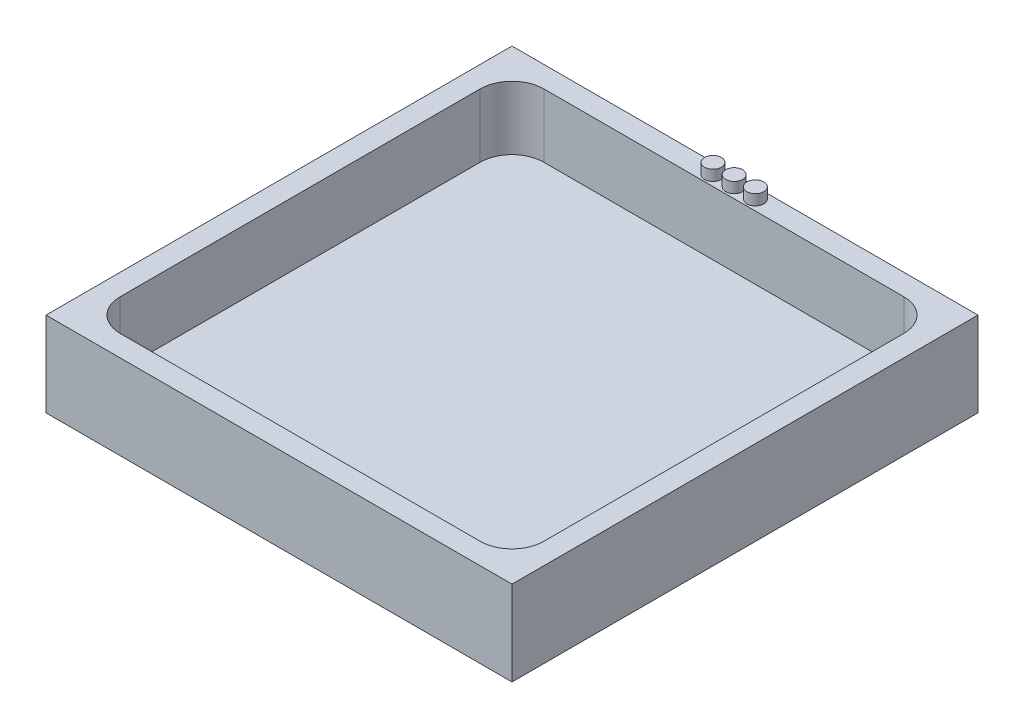
ISO-10303-21;
HEADER;
FILE_DESCRIPTION(('STEP AP214'),'2;1');
FILE_NAME('part.step','',(''),(''),'','','');
FILE_SCHEMA(('AUTOMOTIVE_DESIGN { 1 0 10303 214 1 1 1 1 }'));
ENDSEC;
DATA;
#1=APPLICATION_CONTEXT('core data for automotive mechanical design processes');
#2=APPLICATION_PROTOCOL_DEFINITION('international standard','automotive_design',2000,#1);
#3=PRODUCT_CONTEXT('',#1,'mechanical');
#4=PRODUCT('Part','Part','',(#3));
#5=PRODUCT_RELATED_PRODUCT_CATEGORY('part','',(#4));
#6=PRODUCT_DEFINITION_FORMATION('','',#4);
#7=PRODUCT_DEFINITION_CONTEXT('part definition',#1,'design');
#8=PRODUCT_DEFINITION('design','',#6,#7);
#9=PRODUCT_DEFINITION_SHAPE('','',#8);
#10=(LENGTH_UNIT() NAMED_UNIT(*) SI_UNIT(.MILLI.,.METRE.));
#11=(NAMED_UNIT(*) PLANE_ANGLE_UNIT() SI_UNIT($,.RADIAN.));
#12=(NAMED_UNIT(*) SI_UNIT($,.STERADIAN.) SOLID_ANGLE_UNIT());
#13=UNCERTAINTY_MEASURE_WITH_UNIT(LENGTH_MEASURE(1.E-05),#10,'distance_accuracy_value','');
#14=(GEOMETRIC_REPRESENTATION_CONTEXT(3) GLOBAL_UNCERTAINTY_ASSIGNED_CONTEXT((#13)) GLOBAL_UNIT_ASSIGNED_CONTEXT((#10,
#11,#12)) REPRESENTATION_CONTEXT('',''));
#15=CARTESIAN_POINT('',(0.,0.,0.));
#16=DIRECTION('',(0.,0.,1.));
#17=DIRECTION('',(1.,0.,0.));
#18=AXIS2_PLACEMENT_3D('',#15,#16,#17);
#19=CARTESIAN_POINT('',(0.,1.,0.));
#20=DIRECTION('',(0.,-1.,0.));
#21=DIRECTION('',(0.,0.,-1.));
#22=AXIS2_PLACEMENT_3D('',#19,#20,#21);
#23=PLANE('',#22);
#24=DIRECTION('',(1.,0.,0.));
#25=VECTOR('',#24,1.);
#26=CARTESIAN_POINT('',(-10.,1.,10.));
#27=LINE('',#26,#25);
#28=CARTESIAN_POINT('',(-8.5,1.,10.));
#29=VERTEX_POINT('',#28);
#30=CARTESIAN_POINT('',(8.5,1.,10.));
#31=VERTEX_POINT('',#30);
#32=EDGE_CURVE('E166',#29,#31,#27,.T.);
#33=ORIENTED_EDGE('',*,*,#32,.T.);
#34=CARTESIAN_POINT('',(8.5,1.,8.5));
#35=DIRECTION('',(0.,-1.,0.));
#36=DIRECTION('',(0.,0.,-1.));
#37=AXIS2_PLACEMENT_3D('',#34,#35,#36);
#38=CIRCLE('',#37,1.5);
#39=CARTESIAN_POINT('',(10.,1.,8.5));
#40=VERTEX_POINT('',#39);
#41=EDGE_CURVE('E189',#31,#40,#38,.F.);
#42=ORIENTED_EDGE('',*,*,#41,.T.);
#43=DIRECTION('',(0.,0.,-1.));
#44=VECTOR('',#43,1.);
#45=CARTESIAN_POINT('',(10.,1.,10.));
#46=LINE('',#45,#44);
#47=CARTESIAN_POINT('',(10.,1.,-8.5));
#48=VERTEX_POINT('',#47);
#49=EDGE_CURVE('E163',#40,#48,#46,.T.);
#50=ORIENTED_EDGE('',*,*,#49,.T.);
#51=CARTESIAN_POINT('',(8.5,1.,-8.5));
#52=DIRECTION('',(0.,-1.,0.));
#53=DIRECTION('',(0.,0.,-1.));
#54=AXIS2_PLACEMENT_3D('',#51,#52,#53);
#55=CIRCLE('',#54,1.5);
#56=CARTESIAN_POINT('',(8.5,1.,-10.));
#57=VERTEX_POINT('',#56);
#58=EDGE_CURVE('E183',#48,#57,#55,.F.);
#59=ORIENTED_EDGE('',*,*,#58,.T.);
#60=DIRECTION('',(1.,0.,0.));
#61=VECTOR('',#60,1.);
#62=CARTESIAN_POINT('',(-10.,1.,-10.));
#63=LINE('',#62,#61);
#64=CARTESIAN_POINT('',(-8.5,1.,-10.));
#65=VERTEX_POINT('',#64);
#66=EDGE_CURVE('E155',#65,#57,#63,.T.);
#67=ORIENTED_EDGE('',*,*,#66,.F.);
#68=CARTESIAN_POINT('',(-8.5,1.,-8.5));
#69=DIRECTION('',(0.,-1.,0.));
#70=DIRECTION('',(0.,0.,-1.));
#71=AXIS2_PLACEMENT_3D('',#68,#69,#70);
#72=CIRCLE('',#71,1.5);
#73=CARTESIAN_POINT('',(-10.,1.,-8.5));
#74=VERTEX_POINT('',#73);
#75=EDGE_CURVE('E187',#65,#74,#72,.F.);
#76=ORIENTED_EDGE('',*,*,#75,.T.);
#77=DIRECTION('',(0.,0.,-1.));
#78=VECTOR('',#77,1.);
#79=CARTESIAN_POINT('',(-10.,1.,10.));
#80=LINE('',#79,#78);
#81=CARTESIAN_POINT('',(-10.,1.,8.5));
#82=VERTEX_POINT('',#81);
#83=EDGE_CURVE('E153',#82,#74,#80,.T.);
#84=ORIENTED_EDGE('',*,*,#83,.F.);
#85=CARTESIAN_POINT('',(-8.5,1.,8.5));
#86=DIRECTION('',(0.,-1.,0.));
#87=DIRECTION('',(0.,0.,-1.));
#88=AXIS2_PLACEMENT_3D('',#85,#86,#87);
#89=CIRCLE('',#88,1.5);
#90=EDGE_CURVE('E185',#82,#29,#89,.F.);
#91=ORIENTED_EDGE('',*,*,#90,.T.);
#92=EDGE_LOOP('',(#33,#42,#50,#59,#67,#76,#84,#91));
#93=FACE_BOUND('',#92,.T.);
#94=ADVANCED_FACE('F39',(#93),#23,.F.);
#95=CARTESIAN_POINT('',(10.,4.,10.));
#96=DIRECTION('',(-1.,0.,0.));
#97=DIRECTION('',(0.,0.,1.));
#98=AXIS2_PLACEMENT_3D('',#95,#96,#97);
#99=PLANE('',#98);
#100=ORIENTED_EDGE('',*,*,#49,.F.);
#101=DIRECTION('',(0.,-1.,0.));
#102=VECTOR('',#101,1.);
#103=CARTESIAN_POINT('',(10.,4.,8.5));
#104=LINE('',#103,#102);
#105=CARTESIAN_POINT('',(10.,4.,8.5));
#106=VERTEX_POINT('',#105);
#107=EDGE_CURVE('E194',#40,#106,#104,.F.);
#108=ORIENTED_EDGE('',*,*,#107,.T.);
#109=DIRECTION('',(0.,0.,-1.));
#110=VECTOR('',#109,1.);
#111=CARTESIAN_POINT('',(10.,4.,10.));
#112=LINE('',#111,#110);
#113=CARTESIAN_POINT('',(10.,4.,-8.5));
#114=VERTEX_POINT('',#113);
#115=EDGE_CURVE('E221',#106,#114,#112,.T.);
#116=ORIENTED_EDGE('',*,*,#115,.T.);
#117=DIRECTION('',(0.,-1.,0.));
#118=VECTOR('',#117,1.);
#119=CARTESIAN_POINT('',(10.,1.,-8.5));
#120=LINE('',#119,#118);
#121=EDGE_CURVE('E191',#114,#48,#120,.T.);
#122=ORIENTED_EDGE('',*,*,#121,.T.);
#123=EDGE_LOOP('',(#100,#108,#116,#122));
#124=FACE_BOUND('',#123,.T.);
#125=ADVANCED_FACE('F243',(#124),#99,.T.);
#126=CARTESIAN_POINT('',(-10.,4.,-10.));
#127=DIRECTION('',(0.,0.,1.));
#128=DIRECTION('',(1.,0.,0.));
#129=AXIS2_PLACEMENT_3D('',#126,#127,#128);
#130=PLANE('',#129);
#131=DIRECTION('',(-1.,0.,0.));
#132=VECTOR('',#131,1.);
#133=CARTESIAN_POINT('',(-10.,4.,-10.));
#134=LINE('',#133,#132);
#135=CARTESIAN_POINT('',(8.5,4.,-10.));
#136=VERTEX_POINT('',#135);
#137=CARTESIAN_POINT('',(-8.5,4.,-10.));
#138=VERTEX_POINT('',#137);
#139=EDGE_CURVE('E212',#136,#138,#134,.T.);
#140=ORIENTED_EDGE('',*,*,#139,.T.);
#141=DIRECTION('',(0.,-1.,0.));
#142=VECTOR('',#141,1.);
#143=CARTESIAN_POINT('',(-8.5,1.,-10.));
#144=LINE('',#143,#142);
#145=EDGE_CURVE('E198',#138,#65,#144,.T.);
#146=ORIENTED_EDGE('',*,*,#145,.T.);
#147=ORIENTED_EDGE('',*,*,#66,.T.);
#148=DIRECTION('',(0.,-1.,0.));
#149=VECTOR('',#148,1.);
#150=CARTESIAN_POINT('',(8.5,4.,-10.));
#151=LINE('',#150,#149);
#152=EDGE_CURVE('E196',#57,#136,#151,.F.);
#153=ORIENTED_EDGE('',*,*,#152,.T.);
#154=EDGE_LOOP('',(#140,#146,#147,#153));
#155=FACE_BOUND('',#154,.T.);
#156=ADVANCED_FACE('F218',(#155),#130,.T.);
#157=CARTESIAN_POINT('',(-10.,4.,10.));
#158=DIRECTION('',(1.,0.,0.));
#159=DIRECTION('',(0.,0.,-1.));
#160=AXIS2_PLACEMENT_3D('',#157,#158,#159);
#161=PLANE('',#160);
#162=ORIENTED_EDGE('',*,*,#83,.T.);
#163=DIRECTION('',(0.,-1.,0.));
#164=VECTOR('',#163,1.);
#165=CARTESIAN_POINT('',(-10.,4.,-8.5));
#166=LINE('',#165,#164);
#167=CARTESIAN_POINT('',(-10.,4.,-8.5));
#168=VERTEX_POINT('',#167);
#169=EDGE_CURVE('E60',#74,#168,#166,.F.);
#170=ORIENTED_EDGE('',*,*,#169,.T.);
#171=DIRECTION('',(0.,0.,1.));
#172=VECTOR('',#171,1.);
#173=CARTESIAN_POINT('',(-10.,4.,10.));
#174=LINE('',#173,#172);
#175=CARTESIAN_POINT('',(-10.,4.,8.5));
#176=VERTEX_POINT('',#175);
#177=EDGE_CURVE('E214',#168,#176,#174,.T.);
#178=ORIENTED_EDGE('',*,*,#177,.T.);
#179=DIRECTION('',(0.,-1.,0.));
#180=VECTOR('',#179,1.);
#181=CARTESIAN_POINT('',(-10.,1.,8.5));
#182=LINE('',#181,#180);
#183=EDGE_CURVE('E201',#176,#82,#182,.T.);
#184=ORIENTED_EDGE('',*,*,#183,.T.);
#185=EDGE_LOOP('',(#162,#170,#178,#184));
#186=FACE_BOUND('',#185,.T.);
#187=ADVANCED_FACE('F226',(#186),#161,.T.);
#188=CARTESIAN_POINT('',(-10.,4.,10.));
#189=DIRECTION('',(0.,0.,-1.));
#190=DIRECTION('',(-1.,0.,0.));
#191=AXIS2_PLACEMENT_3D('',#188,#189,#190);
#192=PLANE('',#191);
#193=DIRECTION('',(1.,0.,0.));
#194=VECTOR('',#193,1.);
#195=CARTESIAN_POINT('',(-10.,4.,10.));
#196=LINE('',#195,#194);
#197=CARTESIAN_POINT('',(-8.5,4.,10.));
#198=VERTEX_POINT('',#197);
#199=CARTESIAN_POINT('',(8.5,4.,10.));
#200=VERTEX_POINT('',#199);
#201=EDGE_CURVE('E236',#198,#200,#196,.T.);
#202=ORIENTED_EDGE('',*,*,#201,.T.);
#203=DIRECTION('',(0.,-1.,0.));
#204=VECTOR('',#203,1.);
#205=CARTESIAN_POINT('',(8.5,1.,10.));
#206=LINE('',#205,#204);
#207=EDGE_CURVE('E180',#200,#31,#206,.T.);
#208=ORIENTED_EDGE('',*,*,#207,.T.);
#209=ORIENTED_EDGE('',*,*,#32,.F.);
#210=DIRECTION('',(0.,-1.,0.));
#211=VECTOR('',#210,1.);
#212=CARTESIAN_POINT('',(-8.5,4.,10.));
#213=LINE('',#212,#211);
#214=EDGE_CURVE('E178',#29,#198,#213,.F.);
#215=ORIENTED_EDGE('',*,*,#214,.T.);
#216=EDGE_LOOP('',(#202,#208,#209,#215));
#217=FACE_BOUND('',#216,.T.);
#218=ADVANCED_FACE('F234',(#217),#192,.T.);
#219=CARTESIAN_POINT('',(0.,4.,0.));
#220=DIRECTION('',(0.,-1.,0.));
#221=DIRECTION('',(0.,0.,-1.));
#222=AXIS2_PLACEMENT_3D('',#219,#220,#221);
#223=PLANE('',#222);
#224=CARTESIAN_POINT('',(-1.,4.,-10.4901556882709));
#225=DIRECTION('',(0.,-1.,0.));
#226=DIRECTION('',(0.,0.,-1.));
#227=AXIS2_PLACEMENT_3D('',#224,#225,#226);
#228=CIRCLE('',#227,0.4);
#229=CARTESIAN_POINT('',(-1.,4.,-10.8901556882709));
#230=VERTEX_POINT('',#229);
#231=EDGE_CURVE('E175',#230,#230,#228,.F.);
#232=ORIENTED_EDGE('',*,*,#231,.F.);
#233=EDGE_LOOP('',(#232));
#234=FACE_BOUND('',#233,.T.);
#235=CARTESIAN_POINT('',(1.,4.,-10.4901556882709));
#236=DIRECTION('',(0.,-1.,0.));
#237=DIRECTION('',(0.,0.,-1.));
#238=AXIS2_PLACEMENT_3D('',#235,#236,#237);
#239=CIRCLE('',#238,0.4);
#240=CARTESIAN_POINT('',(1.,4.,-10.8901556882709));
#241=VERTEX_POINT('',#240);
#242=EDGE_CURVE('E172',#241,#241,#239,.F.);
#243=ORIENTED_EDGE('',*,*,#242,.F.);
#244=EDGE_LOOP('',(#243));
#245=FACE_BOUND('',#244,.T.);
#246=CARTESIAN_POINT('',(0.,4.,-10.4901556882709));
#247=DIRECTION('',(0.,-1.,0.));
#248=DIRECTION('',(0.,0.,-1.));
#249=AXIS2_PLACEMENT_3D('',#246,#247,#248);
#250=CIRCLE('',#249,0.4);
#251=CARTESIAN_POINT('',(0.,4.,-10.8901556882709));
#252=VERTEX_POINT('',#251);
#253=EDGE_CURVE('E169',#252,#252,#250,.F.);
#254=ORIENTED_EDGE('',*,*,#253,.F.);
#255=EDGE_LOOP('',(#254));
#256=FACE_BOUND('',#255,.T.);
#257=DIRECTION('',(0.,0.,-1.));
#258=VECTOR('',#257,1.);
#259=CARTESIAN_POINT('',(11.,4.,11.));
#260=LINE('',#259,#258);
#261=CARTESIAN_POINT('',(11.,4.,11.));
#262=VERTEX_POINT('',#261);
#263=CARTESIAN_POINT('',(11.,4.,-11.));
#264=VERTEX_POINT('',#263);
#265=EDGE_CURVE('E139',#262,#264,#260,.T.);
#266=ORIENTED_EDGE('',*,*,#265,.T.);
#267=DIRECTION('',(-1.,0.,0.));
#268=VECTOR('',#267,1.);
#269=CARTESIAN_POINT('',(-11.,4.,-11.));
#270=LINE('',#269,#268);
#271=CARTESIAN_POINT('',(-11.,4.,-11.));
#272=VERTEX_POINT('',#271);
#273=EDGE_CURVE('E128',#264,#272,#270,.T.);
#274=ORIENTED_EDGE('',*,*,#273,.T.);
#275=DIRECTION('',(0.,0.,1.));
#276=VECTOR('',#275,1.);
#277=CARTESIAN_POINT('',(-11.,4.,11.));
#278=LINE('',#277,#276);
#279=CARTESIAN_POINT('',(-11.,4.,11.));
#280=VERTEX_POINT('',#279);
#281=EDGE_CURVE('E138',#272,#280,#278,.T.);
#282=ORIENTED_EDGE('',*,*,#281,.T.);
#283=DIRECTION('',(1.,0.,0.));
#284=VECTOR('',#283,1.);
#285=CARTESIAN_POINT('',(-11.,4.,11.));
#286=LINE('',#285,#284);
#287=EDGE_CURVE('E144',#280,#262,#286,.T.);
#288=ORIENTED_EDGE('',*,*,#287,.T.);
#289=EDGE_LOOP('',(#266,#274,#282,#288));
#290=FACE_BOUND('',#289,.T.);
#291=ORIENTED_EDGE('',*,*,#115,.F.);
#292=CARTESIAN_POINT('',(8.5,4.,8.5));
#293=DIRECTION('',(0.,-1.,0.));
#294=DIRECTION('',(0.,0.,-1.));
#295=AXIS2_PLACEMENT_3D('',#292,#293,#294);
#296=CIRCLE('',#295,1.5);
#297=EDGE_CURVE('E205',#106,#200,#296,.T.);
#298=ORIENTED_EDGE('',*,*,#297,.T.);
#299=ORIENTED_EDGE('',*,*,#201,.F.);
#300=CARTESIAN_POINT('',(-8.5,4.,8.5));
#301=DIRECTION('',(0.,-1.,0.));
#302=DIRECTION('',(0.,0.,-1.));
#303=AXIS2_PLACEMENT_3D('',#300,#301,#302);
#304=CIRCLE('',#303,1.5);
#305=EDGE_CURVE('E47',#198,#176,#304,.T.);
#306=ORIENTED_EDGE('',*,*,#305,.T.);
#307=ORIENTED_EDGE('',*,*,#177,.F.);
#308=CARTESIAN_POINT('',(-8.5,4.,-8.5));
#309=DIRECTION('',(0.,-1.,0.));
#310=DIRECTION('',(0.,0.,-1.));
#311=AXIS2_PLACEMENT_3D('',#308,#309,#310);
#312=CIRCLE('',#311,1.5);
#313=EDGE_CURVE('E207',#168,#138,#312,.T.);
#314=ORIENTED_EDGE('',*,*,#313,.T.);
#315=ORIENTED_EDGE('',*,*,#139,.F.);
#316=CARTESIAN_POINT('',(8.5,4.,-8.5));
#317=DIRECTION('',(0.,-1.,0.));
#318=DIRECTION('',(0.,0.,-1.));
#319=AXIS2_PLACEMENT_3D('',#316,#317,#318);
#320=CIRCLE('',#319,1.5);
#321=EDGE_CURVE('E11',#136,#114,#320,.T.);
#322=ORIENTED_EDGE('',*,*,#321,.T.);
#323=EDGE_LOOP('',(#291,#298,#299,#306,#307,#314,#315,#322));
#324=FACE_BOUND('',#323,.T.);
#325=ADVANCED_FACE('F142',(#234,#245,#256,#290,#324),#223,.F.);
#326=CARTESIAN_POINT('',(11.,4.,11.));
#327=DIRECTION('',(-1.,0.,0.));
#328=DIRECTION('',(0.,0.,1.));
#329=AXIS2_PLACEMENT_3D('',#326,#327,#328);
#330=PLANE('',#329);
#331=DIRECTION('',(0.,0.,-1.));
#332=VECTOR('',#331,1.);
#333=CARTESIAN_POINT('',(11.,0.,11.));
#334=LINE('',#333,#332);
#335=CARTESIAN_POINT('',(11.,0.,11.));
#336=VERTEX_POINT('',#335);
#337=CARTESIAN_POINT('',(11.,0.,-11.));
#338=VERTEX_POINT('',#337);
#339=EDGE_CURVE('E152',#336,#338,#334,.T.);
#340=ORIENTED_EDGE('',*,*,#339,.T.);
#341=DIRECTION('',(0.,-1.,0.));
#342=VECTOR('',#341,1.);
#343=CARTESIAN_POINT('',(11.,4.,-11.));
#344=LINE('',#343,#342);
#345=EDGE_CURVE('E132',#264,#338,#344,.T.);
#346=ORIENTED_EDGE('',*,*,#345,.F.);
#347=ORIENTED_EDGE('',*,*,#265,.F.);
#348=DIRECTION('',(0.,-1.,0.));
#349=VECTOR('',#348,1.);
#350=CARTESIAN_POINT('',(11.,4.,11.));
#351=LINE('',#350,#349);
#352=EDGE_CURVE('E258',#262,#336,#351,.T.);
#353=ORIENTED_EDGE('',*,*,#352,.T.);
#354=EDGE_LOOP('',(#340,#346,#347,#353));
#355=FACE_BOUND('',#354,.T.);
#356=ADVANCED_FACE('F150',(#355),#330,.F.);
#357=CARTESIAN_POINT('',(-11.,4.,-11.));
#358=DIRECTION('',(0.,0.,1.));
#359=DIRECTION('',(1.,0.,0.));
#360=AXIS2_PLACEMENT_3D('',#357,#358,#359);
#361=PLANE('',#360);
#362=DIRECTION('',(-1.,0.,0.));
#363=VECTOR('',#362,1.);
#364=CARTESIAN_POINT('',(-11.,0.,-11.));
#365=LINE('',#364,#363);
#366=CARTESIAN_POINT('',(-11.,0.,-11.));
#367=VERTEX_POINT('',#366);
#368=EDGE_CURVE('E260',#338,#367,#365,.T.);
#369=ORIENTED_EDGE('',*,*,#368,.T.);
#370=DIRECTION('',(0.,-1.,0.));
#371=VECTOR('',#370,1.);
#372=CARTESIAN_POINT('',(-11.,4.,-11.));
#373=LINE('',#372,#371);
#374=EDGE_CURVE('E135',#272,#367,#373,.T.);
#375=ORIENTED_EDGE('',*,*,#374,.F.);
#376=ORIENTED_EDGE('',*,*,#273,.F.);
#377=ORIENTED_EDGE('',*,*,#345,.T.);
#378=EDGE_LOOP('',(#369,#375,#376,#377));
#379=FACE_BOUND('',#378,.T.);
#380=ADVANCED_FACE('F130',(#379),#361,.F.);
#381=CARTESIAN_POINT('',(-11.,4.,11.));
#382=DIRECTION('',(1.,0.,0.));
#383=DIRECTION('',(0.,0.,-1.));
#384=AXIS2_PLACEMENT_3D('',#381,#382,#383);
#385=PLANE('',#384);
#386=DIRECTION('',(0.,0.,1.));
#387=VECTOR('',#386,1.);
#388=CARTESIAN_POINT('',(-11.,0.,11.));
#389=LINE('',#388,#387);
#390=CARTESIAN_POINT('',(-11.,0.,11.));
#391=VERTEX_POINT('',#390);
#392=EDGE_CURVE('E262',#367,#391,#389,.T.);
#393=ORIENTED_EDGE('',*,*,#392,.T.);
#394=DIRECTION('',(0.,-1.,0.));
#395=VECTOR('',#394,1.);
#396=CARTESIAN_POINT('',(-11.,4.,11.));
#397=LINE('',#396,#395);
#398=EDGE_CURVE('E157',#280,#391,#397,.T.);
#399=ORIENTED_EDGE('',*,*,#398,.F.);
#400=ORIENTED_EDGE('',*,*,#281,.F.);
#401=ORIENTED_EDGE('',*,*,#374,.T.);
#402=EDGE_LOOP('',(#393,#399,#400,#401));
#403=FACE_BOUND('',#402,.T.);
#404=ADVANCED_FACE('F274',(#403),#385,.F.);
#405=CARTESIAN_POINT('',(-11.,4.,11.));
#406=DIRECTION('',(0.,0.,-1.));
#407=DIRECTION('',(-1.,0.,0.));
#408=AXIS2_PLACEMENT_3D('',#405,#406,#407);
#409=PLANE('',#408);
#410=DIRECTION('',(1.,0.,0.));
#411=VECTOR('',#410,1.);
#412=CARTESIAN_POINT('',(-11.,0.,11.));
#413=LINE('',#412,#411);
#414=EDGE_CURVE('E148',#391,#336,#413,.T.);
#415=ORIENTED_EDGE('',*,*,#414,.T.);
#416=ORIENTED_EDGE('',*,*,#352,.F.);
#417=ORIENTED_EDGE('',*,*,#287,.F.);
#418=ORIENTED_EDGE('',*,*,#398,.T.);
#419=EDGE_LOOP('',(#415,#416,#417,#418));
#420=FACE_BOUND('',#419,.T.);
#421=ADVANCED_FACE('F269',(#420),#409,.F.);
#422=CARTESIAN_POINT('',(0.,0.,0.));
#423=DIRECTION('',(0.,-1.,0.));
#424=DIRECTION('',(0.,0.,-1.));
#425=AXIS2_PLACEMENT_3D('',#422,#423,#424);
#426=PLANE('',#425);
#427=ORIENTED_EDGE('',*,*,#339,.F.);
#428=ORIENTED_EDGE('',*,*,#414,.F.);
#429=ORIENTED_EDGE('',*,*,#392,.F.);
#430=ORIENTED_EDGE('',*,*,#368,.F.);
#431=EDGE_LOOP('',(#427,#428,#429,#430));
#432=FACE_BOUND('',#431,.T.);
#433=ADVANCED_FACE('F273',(#432),#426,.T.);
#434=CARTESIAN_POINT('',(0.,4.5,-10.4901556882709));
#435=DIRECTION('',(0.,-1.,0.));
#436=DIRECTION('',(0.,0.,-1.));
#437=AXIS2_PLACEMENT_3D('',#434,#435,#436);
#438=CYLINDRICAL_SURFACE('',#437,0.4);
#439=CARTESIAN_POINT('',(0.,4.5,-10.4901556882709));
#440=DIRECTION('',(0.,1.,0.));
#441=DIRECTION('',(0.,0.,1.));
#442=AXIS2_PLACEMENT_3D('',#439,#440,#441);
#443=CIRCLE('',#442,0.4);
#444=CARTESIAN_POINT('',(0.,4.5,-10.0901556882709));
#445=VERTEX_POINT('',#444);
#446=EDGE_CURVE('E247',#445,#445,#443,.T.);
#447=ORIENTED_EDGE('',*,*,#446,.F.);
#448=EDGE_LOOP('',(#447));
#449=FACE_BOUND('',#448,.T.);
#450=ORIENTED_EDGE('',*,*,#253,.T.);
#451=EDGE_LOOP('',(#450));
#452=FACE_BOUND('',#451,.T.);
#453=ADVANCED_FACE('F294',(#449,#452),#438,.T.);
#454=CARTESIAN_POINT('',(0.,4.5,-10.4901556882709));
#455=DIRECTION('',(0.,1.,0.));
#456=DIRECTION('',(0.,0.,1.));
#457=AXIS2_PLACEMENT_3D('',#454,#455,#456);
#458=PLANE('',#457);
#459=ORIENTED_EDGE('',*,*,#446,.T.);
#460=EDGE_LOOP('',(#459));
#461=FACE_BOUND('',#460,.T.);
#462=ADVANCED_FACE('F361',(#461),#458,.T.);
#463=CARTESIAN_POINT('',(1.,4.5,-10.4901556882709));
#464=DIRECTION('',(0.,-1.,0.));
#465=DIRECTION('',(0.,0.,-1.));
#466=AXIS2_PLACEMENT_3D('',#463,#464,#465);
#467=CYLINDRICAL_SURFACE('',#466,0.4);
#468=CARTESIAN_POINT('',(1.,4.5,-10.4901556882709));
#469=DIRECTION('',(0.,1.,0.));
#470=DIRECTION('',(0.,0.,1.));
#471=AXIS2_PLACEMENT_3D('',#468,#469,#470);
#472=CIRCLE('',#471,0.4);
#473=CARTESIAN_POINT('',(1.,4.5,-10.0901556882709));
#474=VERTEX_POINT('',#473);
#475=EDGE_CURVE('E250',#474,#474,#472,.T.);
#476=ORIENTED_EDGE('',*,*,#475,.F.);
#477=EDGE_LOOP('',(#476));
#478=FACE_BOUND('',#477,.T.);
#479=ORIENTED_EDGE('',*,*,#242,.T.);
#480=EDGE_LOOP('',(#479));
#481=FACE_BOUND('',#480,.T.);
#482=ADVANCED_FACE('F351',(#478,#481),#467,.T.);
#483=CARTESIAN_POINT('',(1.,4.5,-10.4901556882709));
#484=DIRECTION('',(0.,1.,0.));
#485=DIRECTION('',(0.,0.,1.));
#486=AXIS2_PLACEMENT_3D('',#483,#484,#485);
#487=PLANE('',#486);
#488=ORIENTED_EDGE('',*,*,#475,.T.);
#489=EDGE_LOOP('',(#488));
#490=FACE_BOUND('',#489,.T.);
#491=ADVANCED_FACE('F341',(#490),#487,.T.);
#492=CARTESIAN_POINT('',(-1.,4.5,-10.4901556882709));
#493=DIRECTION('',(0.,-1.,0.));
#494=DIRECTION('',(0.,0.,-1.));
#495=AXIS2_PLACEMENT_3D('',#492,#493,#494);
#496=CYLINDRICAL_SURFACE('',#495,0.4);
#497=CARTESIAN_POINT('',(-1.,4.5,-10.4901556882709));
#498=DIRECTION('',(0.,1.,0.));
#499=DIRECTION('',(0.,0.,1.));
#500=AXIS2_PLACEMENT_3D('',#497,#498,#499);
#501=CIRCLE('',#500,0.4);
#502=CARTESIAN_POINT('',(-1.,4.5,-10.0901556882709));
#503=VERTEX_POINT('',#502);
#504=EDGE_CURVE('E468',#503,#503,#501,.T.);
#505=ORIENTED_EDGE('',*,*,#504,.F.);
#506=EDGE_LOOP('',(#505));
#507=FACE_BOUND('',#506,.T.);
#508=ORIENTED_EDGE('',*,*,#231,.T.);
#509=EDGE_LOOP('',(#508));
#510=FACE_BOUND('',#509,.T.);
#511=ADVANCED_FACE('F331',(#507,#510),#496,.T.);
#512=CARTESIAN_POINT('',(-1.,4.5,-10.4901556882709));
#513=DIRECTION('',(0.,1.,0.));
#514=DIRECTION('',(0.,0.,1.));
#515=AXIS2_PLACEMENT_3D('',#512,#513,#514);
#516=PLANE('',#515);
#517=ORIENTED_EDGE('',*,*,#504,.T.);
#518=EDGE_LOOP('',(#517));
#519=FACE_BOUND('',#518,.T.);
#520=ADVANCED_FACE('F297',(#519),#516,.T.);
#521=CARTESIAN_POINT('',(8.5,4.,8.5));
#522=DIRECTION('',(0.,1.,0.));
#523=DIRECTION('',(0.,0.,1.));
#524=AXIS2_PLACEMENT_3D('',#521,#522,#523);
#525=CYLINDRICAL_SURFACE('',#524,1.5);
#526=ORIENTED_EDGE('',*,*,#297,.F.);
#527=ORIENTED_EDGE('',*,*,#107,.F.);
#528=ORIENTED_EDGE('',*,*,#41,.F.);
#529=ORIENTED_EDGE('',*,*,#207,.F.);
#530=EDGE_LOOP('',(#526,#527,#528,#529));
#531=FACE_BOUND('',#530,.T.);
#532=ADVANCED_FACE('F239',(#531),#525,.F.);
#533=CARTESIAN_POINT('',(-8.5,4.,-8.5));
#534=DIRECTION('',(0.,1.,0.));
#535=DIRECTION('',(0.,0.,1.));
#536=AXIS2_PLACEMENT_3D('',#533,#534,#535);
#537=CYLINDRICAL_SURFACE('',#536,1.5);
#538=ORIENTED_EDGE('',*,*,#313,.F.);
#539=ORIENTED_EDGE('',*,*,#169,.F.);
#540=ORIENTED_EDGE('',*,*,#75,.F.);
#541=ORIENTED_EDGE('',*,*,#145,.F.);
#542=EDGE_LOOP('',(#538,#539,#540,#541));
#543=FACE_BOUND('',#542,.T.);
#544=ADVANCED_FACE('F223',(#543),#537,.F.);
#545=CARTESIAN_POINT('',(-8.5,4.,8.5));
#546=DIRECTION('',(0.,1.,0.));
#547=DIRECTION('',(0.,0.,1.));
#548=AXIS2_PLACEMENT_3D('',#545,#546,#547);
#549=CYLINDRICAL_SURFACE('',#548,1.5);
#550=ORIENTED_EDGE('',*,*,#305,.F.);
#551=ORIENTED_EDGE('',*,*,#214,.F.);
#552=ORIENTED_EDGE('',*,*,#90,.F.);
#553=ORIENTED_EDGE('',*,*,#183,.F.);
#554=EDGE_LOOP('',(#550,#551,#552,#553));
#555=FACE_BOUND('',#554,.T.);
#556=ADVANCED_FACE('F229',(#555),#549,.F.);
#557=CARTESIAN_POINT('',(8.5,4.,-8.5));
#558=DIRECTION('',(0.,1.,0.));
#559=DIRECTION('',(0.,0.,1.));
#560=AXIS2_PLACEMENT_3D('',#557,#558,#559);
#561=CYLINDRICAL_SURFACE('',#560,1.5);
#562=ORIENTED_EDGE('',*,*,#321,.F.);
#563=ORIENTED_EDGE('',*,*,#152,.F.);
#564=ORIENTED_EDGE('',*,*,#58,.F.);
#565=ORIENTED_EDGE('',*,*,#121,.F.);
#566=EDGE_LOOP('',(#562,#563,#564,#565));
#567=FACE_BOUND('',#566,.T.);
#568=ADVANCED_FACE('F41',(#567),#561,.F.);
#569=CLOSED_SHELL('',(#94,#125,#156,#187,#218,#325,#356,#380,#404,#421,#433,#453,#462,#482,#491,
#511,#520,#532,#544,#556,#568));
#570=MANIFOLD_SOLID_BREP('B2',#569);
#571=ADVANCED_BREP_SHAPE_REPRESENTATION('',(#18,#570),#14);
#572=SHAPE_DEFINITION_REPRESENTATION(#9,#571);
ENDSEC;
END-ISO-10303-21;
